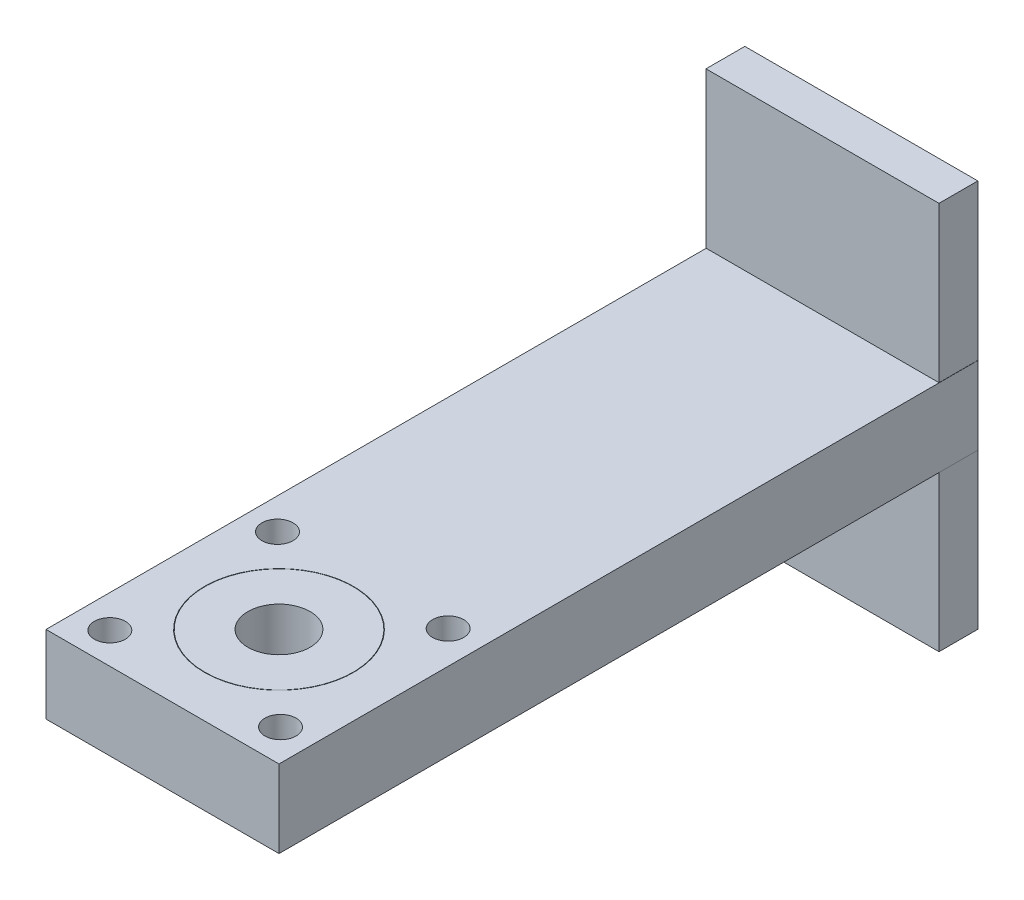
ISO-10303-21;
HEADER;
FILE_DESCRIPTION(('STEP AP214'),'2;1');
FILE_NAME('part.step','',(''),(''),'','','');
FILE_SCHEMA(('AUTOMOTIVE_DESIGN { 1 0 10303 214 1 1 1 1 }'));
ENDSEC;
DATA;
#1=APPLICATION_CONTEXT('core data for automotive mechanical design processes');
#2=APPLICATION_PROTOCOL_DEFINITION('international standard','automotive_design',2000,#1);
#3=PRODUCT_CONTEXT('',#1,'mechanical');
#4=PRODUCT('Part','Part','',(#3));
#5=PRODUCT_RELATED_PRODUCT_CATEGORY('part','',(#4));
#6=PRODUCT_DEFINITION_FORMATION('','',#4);
#7=PRODUCT_DEFINITION_CONTEXT('part definition',#1,'design');
#8=PRODUCT_DEFINITION('design','',#6,#7);
#9=PRODUCT_DEFINITION_SHAPE('','',#8);
#10=(LENGTH_UNIT() NAMED_UNIT(*) SI_UNIT(.MILLI.,.METRE.));
#11=(NAMED_UNIT(*) PLANE_ANGLE_UNIT() SI_UNIT($,.RADIAN.));
#12=(NAMED_UNIT(*) SI_UNIT($,.STERADIAN.) SOLID_ANGLE_UNIT());
#13=UNCERTAINTY_MEASURE_WITH_UNIT(LENGTH_MEASURE(1.E-05),#10,'distance_accuracy_value','');
#14=(GEOMETRIC_REPRESENTATION_CONTEXT(3) GLOBAL_UNCERTAINTY_ASSIGNED_CONTEXT((#13)) GLOBAL_UNIT_ASSIGNED_CONTEXT((#10,
#11,#12)) REPRESENTATION_CONTEXT('',''));
#15=CARTESIAN_POINT('',(0.,0.,0.));
#16=DIRECTION('',(0.,0.,1.));
#17=DIRECTION('',(1.,0.,0.));
#18=AXIS2_PLACEMENT_3D('',#15,#16,#17);
#19=CARTESIAN_POINT('',(15.,10.,-15.));
#20=DIRECTION('',(-1.,0.,0.));
#21=DIRECTION('',(0.,0.,1.));
#22=AXIS2_PLACEMENT_3D('',#19,#20,#21);
#23=PLANE('',#22);
#24=DIRECTION('',(0.,0.,-1.));
#25=VECTOR('',#24,1.);
#26=CARTESIAN_POINT('',(15.,0.,-15.));
#27=LINE('',#26,#25);
#28=CARTESIAN_POINT('',(15.,0.,15.));
#29=VERTEX_POINT('',#28);
#30=CARTESIAN_POINT('',(15.,0.,-75.));
#31=VERTEX_POINT('',#30);
#32=EDGE_CURVE('E255',#29,#31,#27,.T.);
#33=ORIENTED_EDGE('',*,*,#32,.T.);
#34=DIRECTION('',(0.,-1.,0.));
#35=VECTOR('',#34,1.);
#36=CARTESIAN_POINT('',(15.,10.,-75.));
#37=LINE('',#36,#35);
#38=CARTESIAN_POINT('',(15.,10.,-75.));
#39=VERTEX_POINT('',#38);
#40=EDGE_CURVE('E193',#39,#31,#37,.T.);
#41=ORIENTED_EDGE('',*,*,#40,.F.);
#42=DIRECTION('',(0.,0.,-1.));
#43=VECTOR('',#42,1.);
#44=CARTESIAN_POINT('',(15.,10.,-15.));
#45=LINE('',#44,#43);
#46=CARTESIAN_POINT('',(15.,10.,15.));
#47=VERTEX_POINT('',#46);
#48=EDGE_CURVE('E259',#47,#39,#45,.T.);
#49=ORIENTED_EDGE('',*,*,#48,.F.);
#50=DIRECTION('',(0.,-1.,0.));
#51=VECTOR('',#50,1.);
#52=CARTESIAN_POINT('',(15.,10.,15.));
#53=LINE('',#52,#51);
#54=EDGE_CURVE('E268',#47,#29,#53,.T.);
#55=ORIENTED_EDGE('',*,*,#54,.T.);
#56=EDGE_LOOP('',(#33,#41,#49,#55));
#57=FACE_BOUND('',#56,.T.);
#58=ADVANCED_FACE('F39',(#57),#23,.F.);
#59=CARTESIAN_POINT('',(-15.,10.,-15.));
#60=DIRECTION('',(1.,0.,0.));
#61=DIRECTION('',(0.,0.,-1.));
#62=AXIS2_PLACEMENT_3D('',#59,#60,#61);
#63=PLANE('',#62);
#64=DIRECTION('',(0.,0.,1.));
#65=VECTOR('',#64,1.);
#66=CARTESIAN_POINT('',(-15.,10.,-15.));
#67=LINE('',#66,#65);
#68=CARTESIAN_POINT('',(-15.,10.,-70.));
#69=VERTEX_POINT('',#68);
#70=CARTESIAN_POINT('',(-15.,10.,15.));
#71=VERTEX_POINT('',#70);
#72=EDGE_CURVE('E262',#69,#71,#67,.T.);
#73=ORIENTED_EDGE('',*,*,#72,.F.);
#74=DIRECTION('',(0.,-1.,0.));
#75=VECTOR('',#74,1.);
#76=CARTESIAN_POINT('',(-15.,10.,-70.));
#77=LINE('',#76,#75);
#78=CARTESIAN_POINT('',(-15.,0.,-70.));
#79=VERTEX_POINT('',#78);
#80=EDGE_CURVE('E187',#69,#79,#77,.T.);
#81=ORIENTED_EDGE('',*,*,#80,.T.);
#82=DIRECTION('',(0.,0.,1.));
#83=VECTOR('',#82,1.);
#84=CARTESIAN_POINT('',(-15.,0.,-15.));
#85=LINE('',#84,#83);
#86=CARTESIAN_POINT('',(-15.,0.,15.));
#87=VERTEX_POINT('',#86);
#88=EDGE_CURVE('E67',#79,#87,#85,.T.);
#89=ORIENTED_EDGE('',*,*,#88,.T.);
#90=DIRECTION('',(0.,-1.,0.));
#91=VECTOR('',#90,1.);
#92=CARTESIAN_POINT('',(-15.,10.,15.));
#93=LINE('',#92,#91);
#94=EDGE_CURVE('E48',#71,#87,#93,.T.);
#95=ORIENTED_EDGE('',*,*,#94,.F.);
#96=EDGE_LOOP('',(#73,#81,#89,#95));
#97=FACE_BOUND('',#96,.T.);
#98=ADVANCED_FACE('F319',(#97),#63,.F.);
#99=CARTESIAN_POINT('',(-15.,10.,15.));
#100=DIRECTION('',(0.,0.,-1.));
#101=DIRECTION('',(-1.,0.,0.));
#102=AXIS2_PLACEMENT_3D('',#99,#100,#101);
#103=PLANE('',#102);
#104=DIRECTION('',(1.,0.,0.));
#105=VECTOR('',#104,1.);
#106=CARTESIAN_POINT('',(-15.,0.,15.));
#107=LINE('',#106,#105);
#108=EDGE_CURVE('E263',#87,#29,#107,.T.);
#109=ORIENTED_EDGE('',*,*,#108,.T.);
#110=ORIENTED_EDGE('',*,*,#54,.F.);
#111=DIRECTION('',(1.,0.,0.));
#112=VECTOR('',#111,1.);
#113=CARTESIAN_POINT('',(-15.,10.,15.));
#114=LINE('',#113,#112);
#115=EDGE_CURVE('E56',#71,#47,#114,.T.);
#116=ORIENTED_EDGE('',*,*,#115,.F.);
#117=ORIENTED_EDGE('',*,*,#94,.T.);
#118=EDGE_LOOP('',(#109,#110,#116,#117));
#119=FACE_BOUND('',#118,.T.);
#120=ADVANCED_FACE('F280',(#119),#103,.F.);
#121=CARTESIAN_POINT('',(0.,10.,0.));
#122=DIRECTION('',(0.,1.,0.));
#123=DIRECTION('',(0.,0.,1.));
#124=AXIS2_PLACEMENT_3D('',#121,#122,#123);
#125=PLANE('',#124);
#126=DIRECTION('',(0.,0.,-1.));
#127=VECTOR('',#126,1.);
#128=CARTESIAN_POINT('',(14.9769555330186,10.,0.));
#129=LINE('',#128,#127);
#130=CARTESIAN_POINT('',(14.9769555330186,10.,-70.));
#131=VERTEX_POINT('',#130);
#132=CARTESIAN_POINT('',(14.9769555330186,10.,-75.));
#133=VERTEX_POINT('',#132);
#134=EDGE_CURVE('E184',#131,#133,#129,.T.);
#135=ORIENTED_EDGE('',*,*,#134,.F.);
#136=DIRECTION('',(1.,0.,0.));
#137=VECTOR('',#136,1.);
#138=CARTESIAN_POINT('',(0.,10.,-70.));
#139=LINE('',#138,#137);
#140=EDGE_CURVE('E190',#69,#131,#139,.T.);
#141=ORIENTED_EDGE('',*,*,#140,.F.);
#142=ORIENTED_EDGE('',*,*,#72,.T.);
#143=ORIENTED_EDGE('',*,*,#115,.T.);
#144=ORIENTED_EDGE('',*,*,#48,.T.);
#145=DIRECTION('',(1.,0.,0.));
#146=VECTOR('',#145,1.);
#147=CARTESIAN_POINT('',(15.,10.,-75.));
#148=LINE('',#147,#146);
#149=EDGE_CURVE('E76',#133,#39,#148,.T.);
#150=ORIENTED_EDGE('',*,*,#149,.F.);
#151=EDGE_LOOP('',(#135,#141,#142,#143,#144,#150));
#152=FACE_BOUND('',#151,.T.);
#153=CARTESIAN_POINT('',(-10.9875097580016,10.,-10.7923497267759));
#154=DIRECTION('',(0.,1.,0.));
#155=DIRECTION('',(1.,0.,0.));
#156=AXIS2_PLACEMENT_3D('',#153,#154,#155);
#157=CIRCLE('',#156,2.);
#158=CARTESIAN_POINT('',(-8.98750975800163,10.,-10.7923497267759));
#159=VERTEX_POINT('',#158);
#160=EDGE_CURVE('E207',#159,#159,#157,.T.);
#161=ORIENTED_EDGE('',*,*,#160,.F.);
#162=EDGE_LOOP('',(#161));
#163=FACE_BOUND('',#162,.T.);
#164=CARTESIAN_POINT('',(-10.792349726776,10.,10.9875097580016));
#165=DIRECTION('',(0.,1.,0.));
#166=DIRECTION('',(0.,0.,-1.));
#167=AXIS2_PLACEMENT_3D('',#164,#165,#166);
#168=CIRCLE('',#167,2.);
#169=CARTESIAN_POINT('',(-10.792349726776,10.,8.9875097580016));
#170=VERTEX_POINT('',#169);
#171=EDGE_CURVE('E208',#170,#170,#168,.T.);
#172=ORIENTED_EDGE('',*,*,#171,.F.);
#173=EDGE_LOOP('',(#172));
#174=FACE_BOUND('',#173,.T.);
#175=CARTESIAN_POINT('',(10.9875097580017,10.,10.7923497267758));
#176=DIRECTION('',(0.,1.,0.));
#177=DIRECTION('',(-1.,0.,0.));
#178=AXIS2_PLACEMENT_3D('',#175,#176,#177);
#179=CIRCLE('',#178,2.);
#180=CARTESIAN_POINT('',(8.98750975800171,10.,10.7923497267759));
#181=VERTEX_POINT('',#180);
#182=EDGE_CURVE('E217',#181,#181,#179,.T.);
#183=ORIENTED_EDGE('',*,*,#182,.F.);
#184=EDGE_LOOP('',(#183));
#185=FACE_BOUND('',#184,.T.);
#186=CARTESIAN_POINT('',(10.792349726776,10.,-10.9875097580016));
#187=DIRECTION('',(0.,1.,0.));
#188=DIRECTION('',(0.,0.,1.));
#189=AXIS2_PLACEMENT_3D('',#186,#187,#188);
#190=CIRCLE('',#189,2.);
#191=CARTESIAN_POINT('',(10.792349726776,10.,-8.9875097580016));
#192=VERTEX_POINT('',#191);
#193=EDGE_CURVE('E212',#192,#192,#190,.T.);
#194=ORIENTED_EDGE('',*,*,#193,.F.);
#195=EDGE_LOOP('',(#194));
#196=FACE_BOUND('',#195,.T.);
#197=CARTESIAN_POINT('',(0.,10.,0.));
#198=DIRECTION('',(0.,1.,0.));
#199=DIRECTION('',(0.,0.,1.));
#200=AXIS2_PLACEMENT_3D('',#197,#198,#199);
#201=CIRCLE('',#200,9.6);
#202=CARTESIAN_POINT('',(0.,10.,9.6));
#203=VERTEX_POINT('',#202);
#204=EDGE_CURVE('E247',#203,#203,#201,.T.);
#205=ORIENTED_EDGE('',*,*,#204,.F.);
#206=EDGE_LOOP('',(#205));
#207=FACE_BOUND('',#206,.T.);
#208=ADVANCED_FACE('F290',(#152,#163,#174,#185,#196,#207),#125,.T.);
#209=CARTESIAN_POINT('',(0.,0.,0.));
#210=DIRECTION('',(0.,1.,0.));
#211=DIRECTION('',(0.,0.,1.));
#212=AXIS2_PLACEMENT_3D('',#209,#210,#211);
#213=PLANE('',#212);
#214=CARTESIAN_POINT('',(-10.9875097580016,0.,-10.7923497267759));
#215=DIRECTION('',(0.,1.,0.));
#216=DIRECTION('',(1.,0.,0.));
#217=AXIS2_PLACEMENT_3D('',#214,#215,#216);
#218=CIRCLE('',#217,2.);
#219=CARTESIAN_POINT('',(-8.98750975800163,0.,-10.7923497267759));
#220=VERTEX_POINT('',#219);
#221=EDGE_CURVE('E203',#220,#220,#218,.T.);
#222=ORIENTED_EDGE('',*,*,#221,.T.);
#223=EDGE_LOOP('',(#222));
#224=FACE_BOUND('',#223,.T.);
#225=CARTESIAN_POINT('',(-10.792349726776,0.,10.9875097580016));
#226=DIRECTION('',(0.,1.,0.));
#227=DIRECTION('',(0.,0.,-1.));
#228=AXIS2_PLACEMENT_3D('',#225,#226,#227);
#229=CIRCLE('',#228,2.);
#230=CARTESIAN_POINT('',(-10.792349726776,0.,8.9875097580016));
#231=VERTEX_POINT('',#230);
#232=EDGE_CURVE('E213',#231,#231,#229,.T.);
#233=ORIENTED_EDGE('',*,*,#232,.T.);
#234=EDGE_LOOP('',(#233));
#235=FACE_BOUND('',#234,.T.);
#236=CARTESIAN_POINT('',(10.9875097580017,0.,10.7923497267758));
#237=DIRECTION('',(0.,1.,0.));
#238=DIRECTION('',(-1.,0.,0.));
#239=AXIS2_PLACEMENT_3D('',#236,#237,#238);
#240=CIRCLE('',#239,2.);
#241=CARTESIAN_POINT('',(8.98750975800171,0.,10.7923497267759));
#242=VERTEX_POINT('',#241);
#243=EDGE_CURVE('E202',#242,#242,#240,.T.);
#244=ORIENTED_EDGE('',*,*,#243,.T.);
#245=EDGE_LOOP('',(#244));
#246=FACE_BOUND('',#245,.T.);
#247=CARTESIAN_POINT('',(10.792349726776,0.,-10.9875097580016));
#248=DIRECTION('',(0.,1.,0.));
#249=DIRECTION('',(0.,0.,1.));
#250=AXIS2_PLACEMENT_3D('',#247,#248,#249);
#251=CIRCLE('',#250,2.);
#252=CARTESIAN_POINT('',(10.792349726776,0.,-8.9875097580016));
#253=VERTEX_POINT('',#252);
#254=EDGE_CURVE('E227',#253,#253,#251,.T.);
#255=ORIENTED_EDGE('',*,*,#254,.T.);
#256=EDGE_LOOP('',(#255));
#257=FACE_BOUND('',#256,.T.);
#258=DIRECTION('',(1.,0.,0.));
#259=VECTOR('',#258,1.);
#260=CARTESIAN_POINT('',(0.,0.,-70.));
#261=LINE('',#260,#259);
#262=CARTESIAN_POINT('',(14.9769555330186,0.,-70.));
#263=VERTEX_POINT('',#262);
#264=EDGE_CURVE('E11',#79,#263,#261,.T.);
#265=ORIENTED_EDGE('',*,*,#264,.T.);
#266=DIRECTION('',(0.,0.,-1.));
#267=VECTOR('',#266,1.);
#268=CARTESIAN_POINT('',(14.9769555330186,0.,0.));
#269=LINE('',#268,#267);
#270=CARTESIAN_POINT('',(14.9769555330186,0.,-75.));
#271=VERTEX_POINT('',#270);
#272=EDGE_CURVE('E174',#263,#271,#269,.T.);
#273=ORIENTED_EDGE('',*,*,#272,.T.);
#274=DIRECTION('',(-1.,0.,0.));
#275=VECTOR('',#274,1.);
#276=CARTESIAN_POINT('',(15.,0.,-75.));
#277=LINE('',#276,#275);
#278=EDGE_CURVE('E196',#31,#271,#277,.T.);
#279=ORIENTED_EDGE('',*,*,#278,.F.);
#280=ORIENTED_EDGE('',*,*,#32,.F.);
#281=ORIENTED_EDGE('',*,*,#108,.F.);
#282=ORIENTED_EDGE('',*,*,#88,.F.);
#283=EDGE_LOOP('',(#265,#273,#279,#280,#281,#282));
#284=FACE_BOUND('',#283,.T.);
#285=ADVANCED_FACE('F284',(#224,#235,#246,#257,#284),#213,.F.);
#286=CARTESIAN_POINT('',(0.,3.,0.));
#287=DIRECTION('',(0.,1.,0.));
#288=DIRECTION('',(0.,0.,1.));
#289=AXIS2_PLACEMENT_3D('',#286,#287,#288);
#290=CYLINDRICAL_SURFACE('',#289,9.6);
#291=CARTESIAN_POINT('',(0.,3.,0.));
#292=DIRECTION('',(0.,1.,0.));
#293=DIRECTION('',(0.,0.,1.));
#294=AXIS2_PLACEMENT_3D('',#291,#292,#293);
#295=CIRCLE('',#294,9.6);
#296=CARTESIAN_POINT('',(0.,3.,9.6));
#297=VERTEX_POINT('',#296);
#298=EDGE_CURVE('E251',#297,#297,#295,.T.);
#299=ORIENTED_EDGE('',*,*,#298,.F.);
#300=EDGE_LOOP('',(#299));
#301=FACE_BOUND('',#300,.T.);
#302=ORIENTED_EDGE('',*,*,#204,.T.);
#303=EDGE_LOOP('',(#302));
#304=FACE_BOUND('',#303,.T.);
#305=ADVANCED_FACE('F330',(#301,#304),#290,.F.);
#306=CARTESIAN_POINT('',(0.,3.,0.));
#307=DIRECTION('',(0.,1.,0.));
#308=DIRECTION('',(0.,0.,1.));
#309=AXIS2_PLACEMENT_3D('',#306,#307,#308);
#310=PLANE('',#309);
#311=CARTESIAN_POINT('',(0.,3.,0.));
#312=DIRECTION('',(0.,1.,0.));
#313=DIRECTION('',(0.,0.,1.));
#314=AXIS2_PLACEMENT_3D('',#311,#312,#313);
#315=CIRCLE('',#314,9.55);
#316=CARTESIAN_POINT('',(0.,3.,9.55));
#317=VERTEX_POINT('',#316);
#318=EDGE_CURVE('E243',#317,#317,#315,.T.);
#319=ORIENTED_EDGE('',*,*,#318,.F.);
#320=EDGE_LOOP('',(#319));
#321=FACE_BOUND('',#320,.T.);
#322=ORIENTED_EDGE('',*,*,#298,.T.);
#323=EDGE_LOOP('',(#322));
#324=FACE_BOUND('',#323,.T.);
#325=ADVANCED_FACE('F337',(#321,#324),#310,.T.);
#326=CARTESIAN_POINT('',(0.,3.,0.));
#327=DIRECTION('',(0.,1.,0.));
#328=DIRECTION('',(0.,0.,1.));
#329=AXIS2_PLACEMENT_3D('',#326,#327,#328);
#330=CYLINDRICAL_SURFACE('',#329,9.55);
#331=ORIENTED_EDGE('',*,*,#318,.T.);
#332=EDGE_LOOP('',(#331));
#333=FACE_BOUND('',#332,.T.);
#334=CARTESIAN_POINT('',(0.,10.,0.));
#335=DIRECTION('',(0.,1.,0.));
#336=DIRECTION('',(0.,0.,1.));
#337=AXIS2_PLACEMENT_3D('',#334,#335,#336);
#338=CIRCLE('',#337,9.55);
#339=CARTESIAN_POINT('',(0.,10.,9.55));
#340=VERTEX_POINT('',#339);
#341=EDGE_CURVE('E239',#340,#340,#338,.T.);
#342=ORIENTED_EDGE('',*,*,#341,.F.);
#343=EDGE_LOOP('',(#342));
#344=FACE_BOUND('',#343,.T.);
#345=ADVANCED_FACE('F341',(#333,#344),#330,.T.);
#346=CARTESIAN_POINT('',(0.,10.,0.));
#347=DIRECTION('',(0.,1.,0.));
#348=DIRECTION('',(0.,0.,1.));
#349=AXIS2_PLACEMENT_3D('',#346,#347,#348);
#350=CIRCLE('',#349,4.);
#351=CARTESIAN_POINT('',(0.,10.,4.));
#352=VERTEX_POINT('',#351);
#353=EDGE_CURVE('E231',#352,#352,#350,.T.);
#354=ORIENTED_EDGE('',*,*,#353,.F.);
#355=EDGE_LOOP('',(#354));
#356=FACE_BOUND('',#355,.T.);
#357=ORIENTED_EDGE('',*,*,#341,.T.);
#358=EDGE_LOOP('',(#357));
#359=FACE_BOUND('',#358,.T.);
#360=ADVANCED_FACE('F334',(#356,#359),#125,.T.);
#361=CARTESIAN_POINT('',(0.,3.,0.));
#362=DIRECTION('',(0.,1.,0.));
#363=DIRECTION('',(0.,0.,1.));
#364=AXIS2_PLACEMENT_3D('',#361,#362,#363);
#365=CYLINDRICAL_SURFACE('',#364,4.);
#366=CARTESIAN_POINT('',(0.,3.,0.));
#367=DIRECTION('',(0.,1.,0.));
#368=DIRECTION('',(0.,0.,1.));
#369=AXIS2_PLACEMENT_3D('',#366,#367,#368);
#370=CIRCLE('',#369,4.);
#371=CARTESIAN_POINT('',(0.,3.,4.));
#372=VERTEX_POINT('',#371);
#373=EDGE_CURVE('E235',#372,#372,#370,.T.);
#374=ORIENTED_EDGE('',*,*,#373,.F.);
#375=EDGE_LOOP('',(#374));
#376=FACE_BOUND('',#375,.T.);
#377=ORIENTED_EDGE('',*,*,#353,.T.);
#378=EDGE_LOOP('',(#377));
#379=FACE_BOUND('',#378,.T.);
#380=ADVANCED_FACE('F346',(#376,#379),#365,.F.);
#381=CARTESIAN_POINT('',(0.,3.,0.));
#382=DIRECTION('',(0.,1.,0.));
#383=DIRECTION('',(0.,0.,1.));
#384=AXIS2_PLACEMENT_3D('',#381,#382,#383);
#385=PLANE('',#384);
#386=ORIENTED_EDGE('',*,*,#373,.T.);
#387=EDGE_LOOP('',(#386));
#388=FACE_BOUND('',#387,.T.);
#389=ADVANCED_FACE('F349',(#388),#385,.T.);
#390=CARTESIAN_POINT('',(10.792349726776,0.,-10.9875097580016));
#391=DIRECTION('',(0.,1.,0.));
#392=DIRECTION('',(0.,0.,1.));
#393=AXIS2_PLACEMENT_3D('',#390,#391,#392);
#394=CYLINDRICAL_SURFACE('',#393,2.);
#395=ORIENTED_EDGE('',*,*,#254,.F.);
#396=EDGE_LOOP('',(#395));
#397=FACE_BOUND('',#396,.T.);
#398=ORIENTED_EDGE('',*,*,#193,.T.);
#399=EDGE_LOOP('',(#398));
#400=FACE_BOUND('',#399,.T.);
#401=ADVANCED_FACE('F353',(#397,#400),#394,.F.);
#402=CARTESIAN_POINT('',(10.9875097580017,0.,10.7923497267758));
#403=DIRECTION('',(0.,1.,0.));
#404=DIRECTION('',(-1.,0.,0.));
#405=AXIS2_PLACEMENT_3D('',#402,#403,#404);
#406=CYLINDRICAL_SURFACE('',#405,2.);
#407=ORIENTED_EDGE('',*,*,#243,.F.);
#408=EDGE_LOOP('',(#407));
#409=FACE_BOUND('',#408,.T.);
#410=ORIENTED_EDGE('',*,*,#182,.T.);
#411=EDGE_LOOP('',(#410));
#412=FACE_BOUND('',#411,.T.);
#413=ADVANCED_FACE('F357',(#409,#412),#406,.F.);
#414=CARTESIAN_POINT('',(-10.792349726776,0.,10.9875097580016));
#415=DIRECTION('',(0.,1.,0.));
#416=DIRECTION('',(0.,0.,-1.));
#417=AXIS2_PLACEMENT_3D('',#414,#415,#416);
#418=CYLINDRICAL_SURFACE('',#417,2.);
#419=ORIENTED_EDGE('',*,*,#232,.F.);
#420=EDGE_LOOP('',(#419));
#421=FACE_BOUND('',#420,.T.);
#422=ORIENTED_EDGE('',*,*,#171,.T.);
#423=EDGE_LOOP('',(#422));
#424=FACE_BOUND('',#423,.T.);
#425=ADVANCED_FACE('F361',(#421,#424),#418,.F.);
#426=CARTESIAN_POINT('',(-10.9875097580016,0.,-10.7923497267759));
#427=DIRECTION('',(0.,1.,0.));
#428=DIRECTION('',(1.,0.,0.));
#429=AXIS2_PLACEMENT_3D('',#426,#427,#428);
#430=CYLINDRICAL_SURFACE('',#429,2.);
#431=ORIENTED_EDGE('',*,*,#221,.F.);
#432=EDGE_LOOP('',(#431));
#433=FACE_BOUND('',#432,.T.);
#434=ORIENTED_EDGE('',*,*,#160,.T.);
#435=EDGE_LOOP('',(#434));
#436=FACE_BOUND('',#435,.T.);
#437=ADVANCED_FACE('F313',(#433,#436),#430,.F.);
#438=CARTESIAN_POINT('',(0.,0.,-75.));
#439=DIRECTION('',(0.,0.,-1.));
#440=DIRECTION('',(-1.,0.,0.));
#441=AXIS2_PLACEMENT_3D('',#438,#439,#440);
#442=PLANE('',#441);
#443=DIRECTION('',(0.,-1.,0.));
#444=VECTOR('',#443,1.);
#445=CARTESIAN_POINT('',(14.9769555330186,-20.,-75.));
#446=LINE('',#445,#444);
#447=CARTESIAN_POINT('',(14.9769555330186,30.,-75.));
#448=VERTEX_POINT('',#447);
#449=EDGE_CURVE('E157',#448,#133,#446,.T.);
#450=ORIENTED_EDGE('',*,*,#449,.T.);
#451=ORIENTED_EDGE('',*,*,#149,.T.);
#452=ORIENTED_EDGE('',*,*,#40,.T.);
#453=ORIENTED_EDGE('',*,*,#278,.T.);
#454=CARTESIAN_POINT('',(14.9769555330186,-20.,-75.));
#455=VERTEX_POINT('',#454);
#456=EDGE_CURVE('E169',#271,#455,#446,.T.);
#457=ORIENTED_EDGE('',*,*,#456,.T.);
#458=DIRECTION('',(-1.,0.,0.));
#459=VECTOR('',#458,1.);
#460=CARTESIAN_POINT('',(14.9769555330186,-20.,-75.));
#461=LINE('',#460,#459);
#462=CARTESIAN_POINT('',(-15.0230444669814,-20.,-75.));
#463=VERTEX_POINT('',#462);
#464=EDGE_CURVE('E153',#455,#463,#461,.T.);
#465=ORIENTED_EDGE('',*,*,#464,.T.);
#466=DIRECTION('',(0.,1.,0.));
#467=VECTOR('',#466,1.);
#468=CARTESIAN_POINT('',(-15.0230444669814,-20.,-75.));
#469=LINE('',#468,#467);
#470=CARTESIAN_POINT('',(-15.0230444669814,30.,-75.));
#471=VERTEX_POINT('',#470);
#472=EDGE_CURVE('E164',#463,#471,#469,.T.);
#473=ORIENTED_EDGE('',*,*,#472,.T.);
#474=DIRECTION('',(1.,0.,0.));
#475=VECTOR('',#474,1.);
#476=CARTESIAN_POINT('',(14.9769555330186,30.,-75.));
#477=LINE('',#476,#475);
#478=EDGE_CURVE('E129',#471,#448,#477,.T.);
#479=ORIENTED_EDGE('',*,*,#478,.T.);
#480=EDGE_LOOP('',(#450,#451,#452,#453,#457,#465,#473,#479));
#481=FACE_BOUND('',#480,.T.);
#482=ADVANCED_FACE('F296',(#481),#442,.T.);
#483=CARTESIAN_POINT('',(14.9769555330186,-20.,-70.));
#484=DIRECTION('',(1.,0.,0.));
#485=DIRECTION('',(0.,0.,-1.));
#486=AXIS2_PLACEMENT_3D('',#483,#484,#485);
#487=PLANE('',#486);
#488=ORIENTED_EDGE('',*,*,#272,.F.);
#489=DIRECTION('',(0.,-1.,0.));
#490=VECTOR('',#489,1.);
#491=CARTESIAN_POINT('',(14.9769555330186,-20.,-70.));
#492=LINE('',#491,#490);
#493=CARTESIAN_POINT('',(14.9769555330186,-20.,-70.));
#494=VERTEX_POINT('',#493);
#495=EDGE_CURVE('E148',#263,#494,#492,.T.);
#496=ORIENTED_EDGE('',*,*,#495,.T.);
#497=DIRECTION('',(0.,0.,-1.));
#498=VECTOR('',#497,1.);
#499=CARTESIAN_POINT('',(14.9769555330186,-20.,-70.));
#500=LINE('',#499,#498);
#501=EDGE_CURVE('E175',#494,#455,#500,.T.);
#502=ORIENTED_EDGE('',*,*,#501,.T.);
#503=ORIENTED_EDGE('',*,*,#456,.F.);
#504=EDGE_LOOP('',(#488,#496,#502,#503));
#505=FACE_BOUND('',#504,.T.);
#506=ADVANCED_FACE('F304',(#505),#487,.T.);
#507=CARTESIAN_POINT('',(-15.0230444669814,-20.,-70.));
#508=DIRECTION('',(-1.,0.,0.));
#509=DIRECTION('',(0.,0.,1.));
#510=AXIS2_PLACEMENT_3D('',#507,#508,#509);
#511=PLANE('',#510);
#512=ORIENTED_EDGE('',*,*,#472,.F.);
#513=DIRECTION('',(0.,0.,-1.));
#514=VECTOR('',#513,1.);
#515=CARTESIAN_POINT('',(-15.0230444669814,-20.,-70.));
#516=LINE('',#515,#514);
#517=CARTESIAN_POINT('',(-15.0230444669814,-20.,-70.));
#518=VERTEX_POINT('',#517);
#519=EDGE_CURVE('E151',#518,#463,#516,.T.);
#520=ORIENTED_EDGE('',*,*,#519,.F.);
#521=DIRECTION('',(0.,1.,0.));
#522=VECTOR('',#521,1.);
#523=CARTESIAN_POINT('',(-15.0230444669814,-20.,-70.));
#524=LINE('',#523,#522);
#525=CARTESIAN_POINT('',(-15.0230444669814,30.,-70.));
#526=VERTEX_POINT('',#525);
#527=EDGE_CURVE('E143',#518,#526,#524,.T.);
#528=ORIENTED_EDGE('',*,*,#527,.T.);
#529=DIRECTION('',(0.,0.,-1.));
#530=VECTOR('',#529,1.);
#531=CARTESIAN_POINT('',(-15.0230444669814,30.,-70.));
#532=LINE('',#531,#530);
#533=EDGE_CURVE('E124',#526,#471,#532,.T.);
#534=ORIENTED_EDGE('',*,*,#533,.T.);
#535=EDGE_LOOP('',(#512,#520,#528,#534));
#536=FACE_BOUND('',#535,.T.);
#537=ADVANCED_FACE('F150',(#536),#511,.T.);
#538=CARTESIAN_POINT('',(14.9769555330186,-20.,-70.));
#539=DIRECTION('',(0.,-1.,0.));
#540=DIRECTION('',(0.,0.,-1.));
#541=AXIS2_PLACEMENT_3D('',#538,#539,#540);
#542=PLANE('',#541);
#543=ORIENTED_EDGE('',*,*,#464,.F.);
#544=ORIENTED_EDGE('',*,*,#501,.F.);
#545=DIRECTION('',(-1.,0.,0.));
#546=VECTOR('',#545,1.);
#547=CARTESIAN_POINT('',(14.9769555330186,-20.,-70.));
#548=LINE('',#547,#546);
#549=EDGE_CURVE('E136',#494,#518,#548,.T.);
#550=ORIENTED_EDGE('',*,*,#549,.T.);
#551=ORIENTED_EDGE('',*,*,#519,.T.);
#552=EDGE_LOOP('',(#543,#544,#550,#551));
#553=FACE_BOUND('',#552,.T.);
#554=ADVANCED_FACE('F300',(#553),#542,.T.);
#555=CARTESIAN_POINT('',(14.9769555330186,30.,-70.));
#556=VERTEX_POINT('',#555);
#557=EDGE_CURVE('E146',#556,#131,#492,.T.);
#558=ORIENTED_EDGE('',*,*,#557,.T.);
#559=ORIENTED_EDGE('',*,*,#134,.T.);
#560=ORIENTED_EDGE('',*,*,#449,.F.);
#561=DIRECTION('',(0.,0.,-1.));
#562=VECTOR('',#561,1.);
#563=CARTESIAN_POINT('',(14.9769555330186,30.,-70.));
#564=LINE('',#563,#562);
#565=EDGE_CURVE('E135',#556,#448,#564,.T.);
#566=ORIENTED_EDGE('',*,*,#565,.F.);
#567=EDGE_LOOP('',(#558,#559,#560,#566));
#568=FACE_BOUND('',#567,.T.);
#569=ADVANCED_FACE('F295',(#568),#487,.T.);
#570=CARTESIAN_POINT('',(14.9769555330186,30.,-70.));
#571=DIRECTION('',(0.,1.,0.));
#572=DIRECTION('',(0.,0.,1.));
#573=AXIS2_PLACEMENT_3D('',#570,#571,#572);
#574=PLANE('',#573);
#575=ORIENTED_EDGE('',*,*,#478,.F.);
#576=ORIENTED_EDGE('',*,*,#533,.F.);
#577=DIRECTION('',(1.,0.,0.));
#578=VECTOR('',#577,1.);
#579=CARTESIAN_POINT('',(14.9769555330186,30.,-70.));
#580=LINE('',#579,#578);
#581=EDGE_CURVE('E127',#526,#556,#580,.T.);
#582=ORIENTED_EDGE('',*,*,#581,.T.);
#583=ORIENTED_EDGE('',*,*,#565,.T.);
#584=EDGE_LOOP('',(#575,#576,#582,#583));
#585=FACE_BOUND('',#584,.T.);
#586=ADVANCED_FACE('F126',(#585),#574,.T.);
#587=CARTESIAN_POINT('',(0.,0.,-70.));
#588=DIRECTION('',(0.,0.,1.));
#589=DIRECTION('',(1.,0.,0.));
#590=AXIS2_PLACEMENT_3D('',#587,#588,#589);
#591=PLANE('',#590);
#592=ORIENTED_EDGE('',*,*,#80,.F.);
#593=ORIENTED_EDGE('',*,*,#140,.T.);
#594=ORIENTED_EDGE('',*,*,#557,.F.);
#595=ORIENTED_EDGE('',*,*,#581,.F.);
#596=ORIENTED_EDGE('',*,*,#527,.F.);
#597=ORIENTED_EDGE('',*,*,#549,.F.);
#598=ORIENTED_EDGE('',*,*,#495,.F.);
#599=ORIENTED_EDGE('',*,*,#264,.F.);
#600=EDGE_LOOP('',(#592,#593,#594,#595,#596,#597,#598,#599));
#601=FACE_BOUND('',#600,.T.);
#602=ADVANCED_FACE('F141',(#601),#591,.T.);
#603=CLOSED_SHELL('',(#58,#98,#120,#208,#285,#305,#325,#345,#360,#380,#389,#401,#413,#425,#437,
#482,#506,#537,#554,#569,#586,#602));
#604=MANIFOLD_SOLID_BREP('B2',#603);
#605=ADVANCED_BREP_SHAPE_REPRESENTATION('',(#18,#604),#14);
#606=SHAPE_DEFINITION_REPRESENTATION(#9,#605);
ENDSEC;
END-ISO-10303-21;
